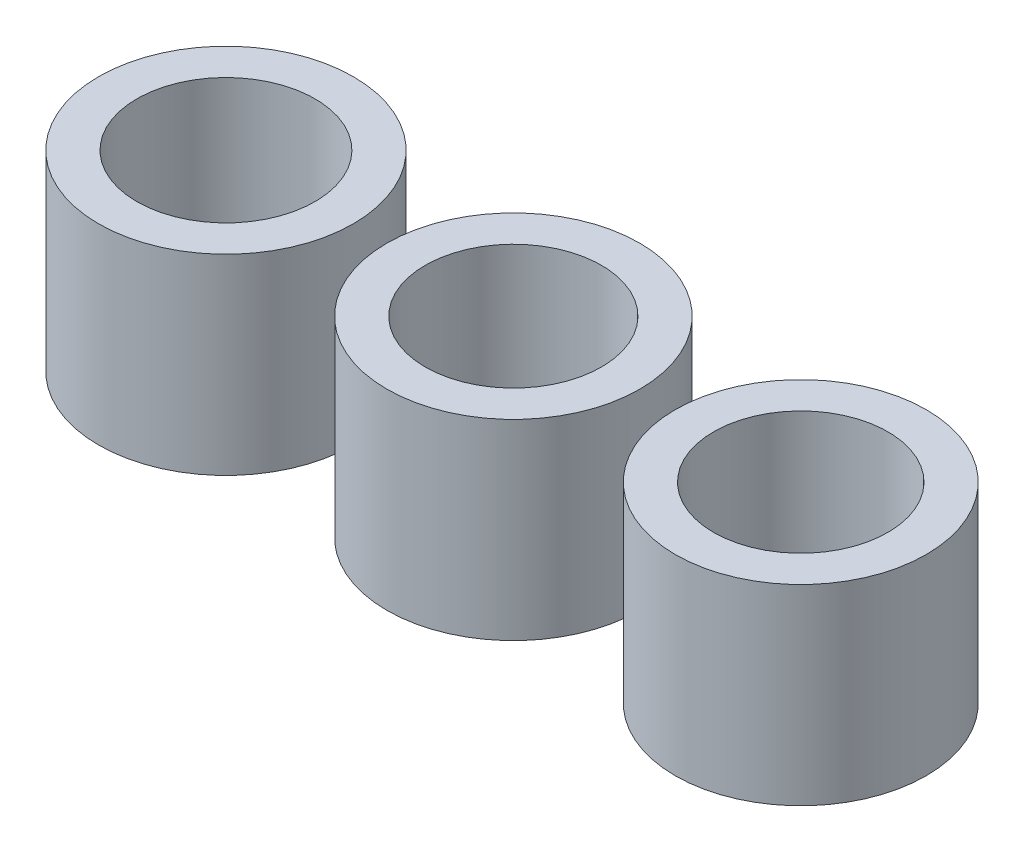
ISO-10303-21;
HEADER;
FILE_DESCRIPTION(('STEP AP214'),'2;1');
FILE_NAME('part.step','',(''),(''),'','','');
FILE_SCHEMA(('AUTOMOTIVE_DESIGN { 1 0 10303 214 1 1 1 1 }'));
ENDSEC;
DATA;
#1=APPLICATION_CONTEXT('core data for automotive mechanical design processes');
#2=APPLICATION_PROTOCOL_DEFINITION('international standard','automotive_design',2000,#1);
#3=PRODUCT_CONTEXT('',#1,'mechanical');
#4=PRODUCT('Part','Part','',(#3));
#5=PRODUCT_RELATED_PRODUCT_CATEGORY('part','',(#4));
#6=PRODUCT_DEFINITION_FORMATION('','',#4);
#7=PRODUCT_DEFINITION_CONTEXT('part definition',#1,'design');
#8=PRODUCT_DEFINITION('design','',#6,#7);
#9=PRODUCT_DEFINITION_SHAPE('','',#8);
#10=(LENGTH_UNIT() NAMED_UNIT(*) SI_UNIT(.MILLI.,.METRE.));
#11=(NAMED_UNIT(*) PLANE_ANGLE_UNIT() SI_UNIT($,.RADIAN.));
#12=(NAMED_UNIT(*) SI_UNIT($,.STERADIAN.) SOLID_ANGLE_UNIT());
#13=UNCERTAINTY_MEASURE_WITH_UNIT(LENGTH_MEASURE(1.E-05),#10,'distance_accuracy_value','');
#14=(GEOMETRIC_REPRESENTATION_CONTEXT(3) GLOBAL_UNCERTAINTY_ASSIGNED_CONTEXT((#13)) GLOBAL_UNIT_ASSIGNED_CONTEXT((#10,
#11,#12)) REPRESENTATION_CONTEXT('',''));
#15=CARTESIAN_POINT('',(0.,0.,0.));
#16=DIRECTION('',(0.,0.,1.));
#17=DIRECTION('',(1.,0.,0.));
#18=AXIS2_PLACEMENT_3D('',#15,#16,#17);
#19=CARTESIAN_POINT('',(30.,10.,0.));
#20=DIRECTION('',(0.,1.,0.));
#21=DIRECTION('',(0.,0.,1.));
#22=AXIS2_PLACEMENT_3D('',#19,#20,#21);
#23=PLANE('',#22);
#24=CARTESIAN_POINT('',(30.,10.,0.));
#25=DIRECTION('',(0.,1.,0.));
#26=DIRECTION('',(0.,0.,1.));
#27=AXIS2_PLACEMENT_3D('',#24,#25,#26);
#28=CIRCLE('',#27,6.55);
#29=CARTESIAN_POINT('',(30.,10.,6.55));
#30=VERTEX_POINT('',#29);
#31=EDGE_CURVE('E11',#30,#30,#28,.T.);
#32=ORIENTED_EDGE('',*,*,#31,.T.);
#33=EDGE_LOOP('',(#32));
#34=FACE_BOUND('',#33,.T.);
#35=CARTESIAN_POINT('',(30.,10.,0.));
#36=DIRECTION('',(0.,1.,0.));
#37=DIRECTION('',(0.,0.,1.));
#38=AXIS2_PLACEMENT_3D('',#35,#36,#37);
#39=CIRCLE('',#38,4.55);
#40=CARTESIAN_POINT('',(30.,10.,4.55));
#41=VERTEX_POINT('',#40);
#42=EDGE_CURVE('E57',#41,#41,#39,.T.);
#43=ORIENTED_EDGE('',*,*,#42,.F.);
#44=EDGE_LOOP('',(#43));
#45=FACE_BOUND('',#44,.T.);
#46=ADVANCED_FACE('F46',(#34,#45),#23,.T.);
#47=CARTESIAN_POINT('',(30.,0.,0.));
#48=DIRECTION('',(0.,1.,0.));
#49=DIRECTION('',(0.,0.,1.));
#50=AXIS2_PLACEMENT_3D('',#47,#48,#49);
#51=PLANE('',#50);
#52=CARTESIAN_POINT('',(30.,0.,0.));
#53=DIRECTION('',(0.,1.,0.));
#54=DIRECTION('',(0.,0.,1.));
#55=AXIS2_PLACEMENT_3D('',#52,#53,#54);
#56=CIRCLE('',#55,6.55);
#57=CARTESIAN_POINT('',(30.,0.,6.55));
#58=VERTEX_POINT('',#57);
#59=EDGE_CURVE('E50',#58,#58,#56,.T.);
#60=ORIENTED_EDGE('',*,*,#59,.F.);
#61=EDGE_LOOP('',(#60));
#62=FACE_BOUND('',#61,.T.);
#63=CARTESIAN_POINT('',(30.,0.,0.));
#64=DIRECTION('',(0.,1.,0.));
#65=DIRECTION('',(0.,0.,1.));
#66=AXIS2_PLACEMENT_3D('',#63,#64,#65);
#67=CIRCLE('',#66,4.55);
#68=CARTESIAN_POINT('',(30.,0.,4.55));
#69=VERTEX_POINT('',#68);
#70=EDGE_CURVE('E59',#69,#69,#67,.T.);
#71=ORIENTED_EDGE('',*,*,#70,.T.);
#72=EDGE_LOOP('',(#71));
#73=FACE_BOUND('',#72,.T.);
#74=ADVANCED_FACE('F69',(#62,#73),#51,.F.);
#75=CARTESIAN_POINT('',(30.,10.,0.));
#76=DIRECTION('',(0.,-1.,0.));
#77=DIRECTION('',(0.,0.,-1.));
#78=AXIS2_PLACEMENT_3D('',#75,#76,#77);
#79=CYLINDRICAL_SURFACE('',#78,6.55);
#80=ORIENTED_EDGE('',*,*,#31,.F.);
#81=EDGE_LOOP('',(#80));
#82=FACE_BOUND('',#81,.T.);
#83=ORIENTED_EDGE('',*,*,#59,.T.);
#84=EDGE_LOOP('',(#83));
#85=FACE_BOUND('',#84,.T.);
#86=ADVANCED_FACE('F48',(#82,#85),#79,.T.);
#87=CARTESIAN_POINT('',(30.,10.,0.));
#88=DIRECTION('',(0.,-1.,0.));
#89=DIRECTION('',(0.,0.,-1.));
#90=AXIS2_PLACEMENT_3D('',#87,#88,#89);
#91=CYLINDRICAL_SURFACE('',#90,4.55);
#92=ORIENTED_EDGE('',*,*,#42,.T.);
#93=EDGE_LOOP('',(#92));
#94=FACE_BOUND('',#93,.T.);
#95=ORIENTED_EDGE('',*,*,#70,.F.);
#96=EDGE_LOOP('',(#95));
#97=FACE_BOUND('',#96,.T.);
#98=ADVANCED_FACE('F65',(#94,#97),#91,.F.);
#99=CLOSED_SHELL('',(#46,#74,#86,#98));
#100=MANIFOLD_SOLID_BREP('B2',#99);
#101=CARTESIAN_POINT('',(15.,10.,0.));
#102=DIRECTION('',(0.,1.,0.));
#103=DIRECTION('',(0.,0.,1.));
#104=AXIS2_PLACEMENT_3D('',#101,#102,#103);
#105=PLANE('',#104);
#106=CARTESIAN_POINT('',(15.,10.,0.));
#107=DIRECTION('',(0.,1.,0.));
#108=DIRECTION('',(0.,0.,1.));
#109=AXIS2_PLACEMENT_3D('',#106,#107,#108);
#110=CIRCLE('',#109,6.59999999999999);
#111=CARTESIAN_POINT('',(15.,10.,6.59999999999999));
#112=VERTEX_POINT('',#111);
#113=EDGE_CURVE('E45',#112,#112,#110,.T.);
#114=ORIENTED_EDGE('',*,*,#113,.T.);
#115=EDGE_LOOP('',(#114));
#116=FACE_BOUND('',#115,.T.);
#117=CARTESIAN_POINT('',(15.,10.,0.));
#118=DIRECTION('',(0.,1.,0.));
#119=DIRECTION('',(0.,0.,1.));
#120=AXIS2_PLACEMENT_3D('',#117,#118,#119);
#121=CIRCLE('',#120,4.6);
#122=CARTESIAN_POINT('',(15.,10.,4.6));
#123=VERTEX_POINT('',#122);
#124=EDGE_CURVE('E126',#123,#123,#121,.T.);
#125=ORIENTED_EDGE('',*,*,#124,.F.);
#126=EDGE_LOOP('',(#125));
#127=FACE_BOUND('',#126,.T.);
#128=ADVANCED_FACE('F115',(#116,#127),#105,.T.);
#129=CARTESIAN_POINT('',(15.,0.,0.));
#130=DIRECTION('',(0.,1.,0.));
#131=DIRECTION('',(0.,0.,1.));
#132=AXIS2_PLACEMENT_3D('',#129,#130,#131);
#133=PLANE('',#132);
#134=CARTESIAN_POINT('',(15.,0.,0.));
#135=DIRECTION('',(0.,1.,0.));
#136=DIRECTION('',(0.,0.,1.));
#137=AXIS2_PLACEMENT_3D('',#134,#135,#136);
#138=CIRCLE('',#137,6.59999999999999);
#139=CARTESIAN_POINT('',(15.,0.,6.59999999999999));
#140=VERTEX_POINT('',#139);
#141=EDGE_CURVE('E119',#140,#140,#138,.T.);
#142=ORIENTED_EDGE('',*,*,#141,.F.);
#143=EDGE_LOOP('',(#142));
#144=FACE_BOUND('',#143,.T.);
#145=CARTESIAN_POINT('',(15.,0.,0.));
#146=DIRECTION('',(0.,1.,0.));
#147=DIRECTION('',(0.,0.,1.));
#148=AXIS2_PLACEMENT_3D('',#145,#146,#147);
#149=CIRCLE('',#148,4.6);
#150=CARTESIAN_POINT('',(15.,0.,4.6));
#151=VERTEX_POINT('',#150);
#152=EDGE_CURVE('E128',#151,#151,#149,.T.);
#153=ORIENTED_EDGE('',*,*,#152,.T.);
#154=EDGE_LOOP('',(#153));
#155=FACE_BOUND('',#154,.T.);
#156=ADVANCED_FACE('F138',(#144,#155),#133,.F.);
#157=CARTESIAN_POINT('',(15.,10.,0.));
#158=DIRECTION('',(0.,-1.,0.));
#159=DIRECTION('',(0.,0.,-1.));
#160=AXIS2_PLACEMENT_3D('',#157,#158,#159);
#161=CYLINDRICAL_SURFACE('',#160,6.59999999999999);
#162=ORIENTED_EDGE('',*,*,#113,.F.);
#163=EDGE_LOOP('',(#162));
#164=FACE_BOUND('',#163,.T.);
#165=ORIENTED_EDGE('',*,*,#141,.T.);
#166=EDGE_LOOP('',(#165));
#167=FACE_BOUND('',#166,.T.);
#168=ADVANCED_FACE('F117',(#164,#167),#161,.T.);
#169=CARTESIAN_POINT('',(15.,10.,0.));
#170=DIRECTION('',(0.,-1.,0.));
#171=DIRECTION('',(0.,0.,-1.));
#172=AXIS2_PLACEMENT_3D('',#169,#170,#171);
#173=CYLINDRICAL_SURFACE('',#172,4.6);
#174=ORIENTED_EDGE('',*,*,#124,.T.);
#175=EDGE_LOOP('',(#174));
#176=FACE_BOUND('',#175,.T.);
#177=ORIENTED_EDGE('',*,*,#152,.F.);
#178=EDGE_LOOP('',(#177));
#179=FACE_BOUND('',#178,.T.);
#180=ADVANCED_FACE('F134',(#176,#179),#173,.F.);
#181=CLOSED_SHELL('',(#128,#156,#168,#180));
#182=MANIFOLD_SOLID_BREP('B6',#181);
#183=CARTESIAN_POINT('',(0.,10.,0.));
#184=DIRECTION('',(0.,1.,0.));
#185=DIRECTION('',(0.,0.,1.));
#186=AXIS2_PLACEMENT_3D('',#183,#184,#185);
#187=PLANE('',#186);
#188=CARTESIAN_POINT('',(0.,10.,0.));
#189=DIRECTION('',(0.,1.,0.));
#190=DIRECTION('',(0.,0.,1.));
#191=AXIS2_PLACEMENT_3D('',#188,#189,#190);
#192=CIRCLE('',#191,6.65);
#193=CARTESIAN_POINT('',(0.,10.,6.65));
#194=VERTEX_POINT('',#193);
#195=EDGE_CURVE('E114',#194,#194,#192,.T.);
#196=ORIENTED_EDGE('',*,*,#195,.T.);
#197=EDGE_LOOP('',(#196));
#198=FACE_BOUND('',#197,.T.);
#199=CARTESIAN_POINT('',(0.,10.,0.));
#200=DIRECTION('',(0.,1.,0.));
#201=DIRECTION('',(0.,0.,1.));
#202=AXIS2_PLACEMENT_3D('',#199,#200,#201);
#203=CIRCLE('',#202,4.65);
#204=CARTESIAN_POINT('',(0.,10.,4.65));
#205=VERTEX_POINT('',#204);
#206=EDGE_CURVE('E190',#205,#205,#203,.T.);
#207=ORIENTED_EDGE('',*,*,#206,.F.);
#208=EDGE_LOOP('',(#207));
#209=FACE_BOUND('',#208,.T.);
#210=ADVANCED_FACE('F177',(#198,#209),#187,.T.);
#211=CARTESIAN_POINT('',(0.,0.,0.));
#212=DIRECTION('',(0.,1.,0.));
#213=DIRECTION('',(0.,0.,1.));
#214=AXIS2_PLACEMENT_3D('',#211,#212,#213);
#215=PLANE('',#214);
#216=CARTESIAN_POINT('',(0.,0.,0.));
#217=DIRECTION('',(0.,1.,0.));
#218=DIRECTION('',(0.,0.,1.));
#219=AXIS2_PLACEMENT_3D('',#216,#217,#218);
#220=CIRCLE('',#219,6.65);
#221=CARTESIAN_POINT('',(0.,0.,6.65));
#222=VERTEX_POINT('',#221);
#223=EDGE_CURVE('E181',#222,#222,#220,.T.);
#224=ORIENTED_EDGE('',*,*,#223,.F.);
#225=EDGE_LOOP('',(#224));
#226=FACE_BOUND('',#225,.T.);
#227=CARTESIAN_POINT('',(0.,0.,0.));
#228=DIRECTION('',(0.,1.,0.));
#229=DIRECTION('',(0.,0.,1.));
#230=AXIS2_PLACEMENT_3D('',#227,#228,#229);
#231=CIRCLE('',#230,4.65);
#232=CARTESIAN_POINT('',(0.,0.,4.65));
#233=VERTEX_POINT('',#232);
#234=EDGE_CURVE('E192',#233,#233,#231,.T.);
#235=ORIENTED_EDGE('',*,*,#234,.T.);
#236=EDGE_LOOP('',(#235));
#237=FACE_BOUND('',#236,.T.);
#238=ADVANCED_FACE('F204',(#226,#237),#215,.F.);
#239=CARTESIAN_POINT('',(0.,10.,0.));
#240=DIRECTION('',(0.,-1.,0.));
#241=DIRECTION('',(0.,0.,-1.));
#242=AXIS2_PLACEMENT_3D('',#239,#240,#241);
#243=CYLINDRICAL_SURFACE('',#242,6.65);
#244=ORIENTED_EDGE('',*,*,#195,.F.);
#245=EDGE_LOOP('',(#244));
#246=FACE_BOUND('',#245,.T.);
#247=ORIENTED_EDGE('',*,*,#223,.T.);
#248=EDGE_LOOP('',(#247));
#249=FACE_BOUND('',#248,.T.);
#250=ADVANCED_FACE('F179',(#246,#249),#243,.T.);
#251=CARTESIAN_POINT('',(0.,10.,0.));
#252=DIRECTION('',(0.,-1.,0.));
#253=DIRECTION('',(0.,0.,-1.));
#254=AXIS2_PLACEMENT_3D('',#251,#252,#253);
#255=CYLINDRICAL_SURFACE('',#254,4.65);
#256=ORIENTED_EDGE('',*,*,#206,.T.);
#257=EDGE_LOOP('',(#256));
#258=FACE_BOUND('',#257,.T.);
#259=ORIENTED_EDGE('',*,*,#234,.F.);
#260=EDGE_LOOP('',(#259));
#261=FACE_BOUND('',#260,.T.);
#262=ADVANCED_FACE('F200',(#258,#261),#255,.F.);
#263=CLOSED_SHELL('',(#210,#238,#250,#262));
#264=MANIFOLD_SOLID_BREP('B40',#263);
#265=ADVANCED_BREP_SHAPE_REPRESENTATION('',(#18,#100,#182,#264),#14);
#266=SHAPE_DEFINITION_REPRESENTATION(#9,#265);
ENDSEC;
END-ISO-10303-21;
